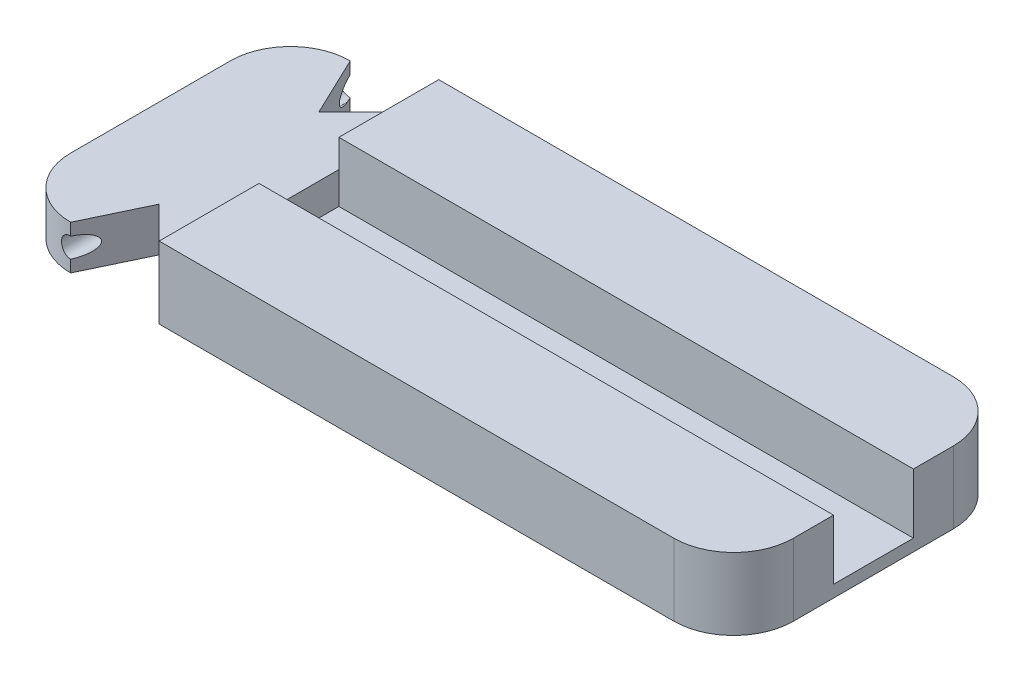
ISO-10303-21;
HEADER;
FILE_DESCRIPTION(('STEP AP214'),'2;1');
FILE_NAME('part.step','',(''),(''),'','','');
FILE_SCHEMA(('AUTOMOTIVE_DESIGN { 1 0 10303 214 1 1 1 1 }'));
ENDSEC;
DATA;
#1=APPLICATION_CONTEXT('core data for automotive mechanical design processes');
#2=APPLICATION_PROTOCOL_DEFINITION('international standard','automotive_design',2000,#1);
#3=PRODUCT_CONTEXT('',#1,'mechanical');
#4=PRODUCT('Part','Part','',(#3));
#5=PRODUCT_RELATED_PRODUCT_CATEGORY('part','',(#4));
#6=PRODUCT_DEFINITION_FORMATION('','',#4);
#7=PRODUCT_DEFINITION_CONTEXT('part definition',#1,'design');
#8=PRODUCT_DEFINITION('design','',#6,#7);
#9=PRODUCT_DEFINITION_SHAPE('','',#8);
#10=(LENGTH_UNIT() NAMED_UNIT(*) SI_UNIT(.MILLI.,.METRE.));
#11=(NAMED_UNIT(*) PLANE_ANGLE_UNIT() SI_UNIT($,.RADIAN.));
#12=(NAMED_UNIT(*) SI_UNIT($,.STERADIAN.) SOLID_ANGLE_UNIT());
#13=UNCERTAINTY_MEASURE_WITH_UNIT(LENGTH_MEASURE(1.E-05),#10,'distance_accuracy_value','');
#14=(GEOMETRIC_REPRESENTATION_CONTEXT(3) GLOBAL_UNCERTAINTY_ASSIGNED_CONTEXT((#13)) GLOBAL_UNIT_ASSIGNED_CONTEXT((#10,
#11,#12)) REPRESENTATION_CONTEXT('',''));
#15=CARTESIAN_POINT('',(0.,0.,0.));
#16=DIRECTION('',(0.,0.,1.));
#17=DIRECTION('',(1.,0.,0.));
#18=AXIS2_PLACEMENT_3D('',#15,#16,#17);
#19=CARTESIAN_POINT('',(75.5,18.,-20.));
#20=DIRECTION('',(0.,-1.,0.));
#21=DIRECTION('',(0.,0.,-1.));
#22=AXIS2_PLACEMENT_3D('',#19,#20,#21);
#23=PLANE('',#22);
#24=DIRECTION('',(0.,0.,-1.));
#25=VECTOR('',#24,1.);
#26=CARTESIAN_POINT('',(-53.344268465114,18.,-35.));
#27=LINE('',#26,#25);
#28=CARTESIAN_POINT('',(-53.344268465114,18.,-10.));
#29=VERTEX_POINT('',#28);
#30=CARTESIAN_POINT('',(-53.344268465114,18.,-35.));
#31=VERTEX_POINT('',#30);
#32=EDGE_CURVE('E259',#29,#31,#27,.T.);
#33=ORIENTED_EDGE('',*,*,#32,.F.);
#34=DIRECTION('',(-1.,0.,0.));
#35=VECTOR('',#34,1.);
#36=CARTESIAN_POINT('',(-53.344268465114,18.,-10.));
#37=LINE('',#36,#35);
#38=CARTESIAN_POINT('',(90.5,18.,-10.));
#39=VERTEX_POINT('',#38);
#40=EDGE_CURVE('E206',#39,#29,#37,.T.);
#41=ORIENTED_EDGE('',*,*,#40,.F.);
#42=DIRECTION('',(0.,0.,1.));
#43=VECTOR('',#42,1.);
#44=CARTESIAN_POINT('',(90.5,18.,-20.));
#45=LINE('',#44,#43);
#46=CARTESIAN_POINT('',(90.5,18.,-20.));
#47=VERTEX_POINT('',#46);
#48=EDGE_CURVE('E312',#47,#39,#45,.T.);
#49=ORIENTED_EDGE('',*,*,#48,.F.);
#50=CARTESIAN_POINT('',(75.5,18.,-20.));
#51=DIRECTION('',(0.,-1.,0.));
#52=DIRECTION('',(0.,0.,-1.));
#53=AXIS2_PLACEMENT_3D('',#50,#51,#52);
#54=CIRCLE('',#53,15.);
#55=CARTESIAN_POINT('',(75.5,18.,-35.));
#56=VERTEX_POINT('',#55);
#57=EDGE_CURVE('E313',#56,#47,#54,.T.);
#58=ORIENTED_EDGE('',*,*,#57,.F.);
#59=DIRECTION('',(1.,0.,0.));
#60=VECTOR('',#59,1.);
#61=CARTESIAN_POINT('',(-75.5,18.,-35.));
#62=LINE('',#61,#60);
#63=EDGE_CURVE('E319',#31,#56,#62,.T.);
#64=ORIENTED_EDGE('',*,*,#63,.F.);
#65=EDGE_LOOP('',(#33,#41,#49,#58,#64));
#66=FACE_BOUND('',#65,.T.);
#67=ADVANCED_FACE('F45',(#66),#23,.F.);
#68=CARTESIAN_POINT('',(-53.344268465114,11.,-35.));
#69=DIRECTION('',(1.,0.,0.));
#70=DIRECTION('',(0.,0.,-1.));
#71=AXIS2_PLACEMENT_3D('',#68,#69,#70);
#72=PLANE('',#71);
#73=DIRECTION('',(0.,0.,-1.));
#74=VECTOR('',#73,1.);
#75=CARTESIAN_POINT('',(-53.344268465114,11.,-35.));
#76=LINE('',#75,#74);
#77=CARTESIAN_POINT('',(-53.344268465114,11.,-10.));
#78=VERTEX_POINT('',#77);
#79=CARTESIAN_POINT('',(-53.344268465114,11.,-35.));
#80=VERTEX_POINT('',#79);
#81=EDGE_CURVE('E405',#78,#80,#76,.T.);
#82=ORIENTED_EDGE('',*,*,#81,.F.);
#83=DIRECTION('',(0.,1.,0.));
#84=VECTOR('',#83,1.);
#85=CARTESIAN_POINT('',(-53.344268465114,11.,-10.));
#86=LINE('',#85,#84);
#87=EDGE_CURVE('E11',#78,#29,#86,.T.);
#88=ORIENTED_EDGE('',*,*,#87,.T.);
#89=ORIENTED_EDGE('',*,*,#32,.T.);
#90=DIRECTION('',(0.,1.,0.));
#91=VECTOR('',#90,1.);
#92=CARTESIAN_POINT('',(-53.344268465114,11.,-35.));
#93=LINE('',#92,#91);
#94=EDGE_CURVE('E408',#80,#31,#93,.T.);
#95=ORIENTED_EDGE('',*,*,#94,.F.);
#96=EDGE_LOOP('',(#82,#88,#89,#95));
#97=FACE_BOUND('',#96,.T.);
#98=ADVANCED_FACE('F267',(#97),#72,.F.);
#99=CARTESIAN_POINT('',(-75.5,18.,-20.));
#100=DIRECTION('',(0.,-1.,0.));
#101=DIRECTION('',(0.,0.,-1.));
#102=AXIS2_PLACEMENT_3D('',#99,#100,#101);
#103=CYLINDRICAL_SURFACE('',#102,15.);
#104=DIRECTION('',(0.,-1.,0.));
#105=VECTOR('',#104,1.);
#106=CARTESIAN_POINT('',(-75.5,18.,-35.));
#107=LINE('',#106,#105);
#108=CARTESIAN_POINT('',(-75.5000000000001,11.,-35.));
#109=VERTEX_POINT('',#108);
#110=CARTESIAN_POINT('',(-75.5,8.,-35.));
#111=VERTEX_POINT('',#110);
#112=EDGE_CURVE('E360',#109,#111,#107,.T.);
#113=ORIENTED_EDGE('',*,*,#112,.T.);
#114=CARTESIAN_POINT('',(-75.5,8.,-35.));
#115=CARTESIAN_POINT('',(-75.5698011569821,8.00000728759552,-35.0000046902532));
#116=CARTESIAN_POINT('',(-75.6395984847442,7.99707674472405,-34.9995128810186));
#117=CARTESIAN_POINT('',(-75.7786844980967,7.9853964712709,-34.9975709664752));
#118=CARTESIAN_POINT('',(-75.8479732326524,7.97664730851365,-34.9961209546751));
#119=CARTESIAN_POINT('',(-75.985468472679,7.95340085874767,-34.9922997269917));
#120=CARTESIAN_POINT('',(-76.053676228338,7.93891080654415,-34.9899296706461));
#121=CARTESIAN_POINT('',(-76.1885946023829,7.90430746059178,-34.984338680445));
#122=CARTESIAN_POINT('',(-76.2553052231973,7.88419417596501,-34.9811177479699));
#123=CARTESIAN_POINT('',(-76.452519163041,7.81560717406301,-34.9703027439545));
#124=CARTESIAN_POINT('',(-76.5801961580564,7.75887071365379,-34.9615537464984));
#125=CARTESIAN_POINT('',(-76.8241486227517,7.6250916693769,-34.9419431437787));
#126=CARTESIAN_POINT('',(-76.9404240252278,7.54804896582922,-34.931081526064));
#127=CARTESIAN_POINT('',(-77.1594617261066,7.37505050886061,-34.9083338380496));
#128=CARTESIAN_POINT('',(-77.2621015701577,7.27894047959154,-34.8964398885049));
#129=CARTESIAN_POINT('',(-77.449881848487,7.07086236563362,-34.8730273406679));
#130=CARTESIAN_POINT('',(-77.5350195055262,6.95889176895109,-34.8615088021892));
#131=CARTESIAN_POINT('',(-77.6858688948242,6.72142571278372,-34.840075357156));
#132=CARTESIAN_POINT('',(-77.7514582099541,6.59585147207279,-34.8301707253743));
#133=CARTESIAN_POINT('',(-77.8605609775346,6.33528265457479,-34.8131974882504));
#134=CARTESIAN_POINT('',(-77.9040771842125,6.20028925547904,-34.8061285291031));
#135=CARTESIAN_POINT('',(-77.9674139710339,5.92602136650627,-34.7957054313148));
#136=CARTESIAN_POINT('',(-77.9874485448792,5.78679759313952,-34.792317765192));
#137=CARTESIAN_POINT('',(-78.0039168160758,5.50692307976073,-34.7895393754027));
#138=CARTESIAN_POINT('',(-78.0003516219806,5.36627240708441,-34.7901484639964));
#139=CARTESIAN_POINT('',(-77.9698950507454,5.08907169662377,-34.7952642967123));
#140=CARTESIAN_POINT('',(-77.9432447203062,4.95249432295285,-34.7997307620545));
#141=CARTESIAN_POINT('',(-77.8677528195122,4.68577785109364,-34.8119950015662));
#142=CARTESIAN_POINT('',(-77.8189106293724,4.55563893283423,-34.8197928687764));
#143=CARTESIAN_POINT('',(-77.7001761747331,4.30476883553954,-34.8378849628515));
#144=CARTESIAN_POINT('',(-77.6301834443452,4.18408609740114,-34.8481910573899));
#145=CARTESIAN_POINT('',(-77.4712085472173,3.956091577392,-34.8701296177779));
#146=CARTESIAN_POINT('',(-77.382225554592,3.84878037737011,-34.8817621413034));
#147=CARTESIAN_POINT('',(-77.1864963382332,3.64918779002656,-34.9052186555504));
#148=CARTESIAN_POINT('',(-77.0795455322428,3.55710700179613,-34.917043244119));
#149=CARTESIAN_POINT('',(-76.8515667060301,3.39214232149392,-34.9394230744496));
#150=CARTESIAN_POINT('',(-76.7305347251196,3.31926384947158,-34.9499779573684));
#151=CARTESIAN_POINT('',(-76.4776240183351,3.19475409092223,-34.9686455903858));
#152=CARTESIAN_POINT('',(-76.3457302661356,3.14315285276235,-34.9767548824368));
#153=CARTESIAN_POINT('',(-76.0750733777964,3.06296384028726,-34.9895815179928));
#154=CARTESIAN_POINT('',(-75.9363208028379,3.03434178666502,-34.9943039127909));
#155=CARTESIAN_POINT('',(-75.7470944944281,3.01174483325429,-34.9980464493542));
#156=CARTESIAN_POINT('',(-75.6977374183934,3.00733866878688,-34.9987784294605));
#157=CARTESIAN_POINT('',(-75.5989274224214,3.00147009035062,-34.9997547015207));
#158=CARTESIAN_POINT('',(-75.5494748054966,3.00000271327631,-34.9999998157015));
#159=CARTESIAN_POINT('',(-75.5,3.00000000000001,-35.));
#160=B_SPLINE_CURVE_WITH_KNOTS('',3,(#114,#115,#116,#117,#118,#119,#120,#121,#122,#123,#124,
#125,#126,#127,#128,#129,#130,#131,#132,#133,#134,#135,#136,#137,#138,#139,#140,#141,#142,#143,
#144,#145,#146,#147,#148,#149,#150,#151,#152,#153,#154,#155,#156,#157,#158,#159),.UNSPECIFIED.,
.F.,.F.,(4,2,2,2,2,2,2,2,2,2,2,2,2,2,2,2,2,2,2,2,2,2,4),(0.,0.209333491845771,0.418646558361396,
0.627696678366011,0.83674645924878,1.25457066181017,1.67239732697976,2.09375371686283,
2.51517691586343,2.93918625952091,3.36314268333222,3.7832046862671,4.20324695774168,
4.61895545583438,5.03467556474893,5.45240225764213,5.87014712114383,6.29301835923139,
6.71600882947926,7.13959463075992,7.56254736567457,7.71115631451634,7.85951407610113),.UNSPECIFIED.);
#161=CARTESIAN_POINT('',(-75.5000000000001,3.00000000000001,-35.));
#162=VERTEX_POINT('',#161);
#163=EDGE_CURVE('E68',#111,#162,#160,.T.);
#164=ORIENTED_EDGE('',*,*,#163,.T.);
#165=CARTESIAN_POINT('',(-75.5000000000001,0.,-35.));
#166=VERTEX_POINT('',#165);
#167=EDGE_CURVE('E365',#162,#166,#107,.T.);
#168=ORIENTED_EDGE('',*,*,#167,.T.);
#169=CARTESIAN_POINT('',(-75.5,0.,-20.));
#170=DIRECTION('',(0.,1.,0.));
#171=DIRECTION('',(0.,0.,1.));
#172=AXIS2_PLACEMENT_3D('',#169,#170,#171);
#173=CIRCLE('',#172,15.);
#174=CARTESIAN_POINT('',(-90.5,0.,-20.));
#175=VERTEX_POINT('',#174);
#176=EDGE_CURVE('E356',#166,#175,#173,.T.);
#177=ORIENTED_EDGE('',*,*,#176,.T.);
#178=DIRECTION('',(0.,-1.,0.));
#179=VECTOR('',#178,1.);
#180=CARTESIAN_POINT('',(-90.5,18.,-20.));
#181=LINE('',#180,#179);
#182=CARTESIAN_POINT('',(-90.5,11.,-20.));
#183=VERTEX_POINT('',#182);
#184=EDGE_CURVE('E366',#183,#175,#181,.T.);
#185=ORIENTED_EDGE('',*,*,#184,.F.);
#186=CARTESIAN_POINT('',(-75.5,11.,-20.));
#187=DIRECTION('',(0.,1.,0.));
#188=DIRECTION('',(0.,0.,1.));
#189=AXIS2_PLACEMENT_3D('',#186,#187,#188);
#190=CIRCLE('',#189,15.);
#191=EDGE_CURVE('E430',#109,#183,#190,.T.);
#192=ORIENTED_EDGE('',*,*,#191,.F.);
#193=EDGE_LOOP('',(#113,#164,#168,#177,#185,#192));
#194=FACE_BOUND('',#193,.T.);
#195=ADVANCED_FACE('F262',(#194),#103,.T.);
#196=CARTESIAN_POINT('',(-90.5,18.,20.));
#197=DIRECTION('',(-1.,0.,0.));
#198=DIRECTION('',(0.,0.,1.));
#199=AXIS2_PLACEMENT_3D('',#196,#197,#198);
#200=PLANE('',#199);
#201=DIRECTION('',(0.,-1.,0.));
#202=VECTOR('',#201,1.);
#203=CARTESIAN_POINT('',(-90.5,18.,20.));
#204=LINE('',#203,#202);
#205=CARTESIAN_POINT('',(-90.5,11.,20.));
#206=VERTEX_POINT('',#205);
#207=CARTESIAN_POINT('',(-90.5,0.,20.));
#208=VERTEX_POINT('',#207);
#209=EDGE_CURVE('E369',#206,#208,#204,.T.);
#210=ORIENTED_EDGE('',*,*,#209,.F.);
#211=DIRECTION('',(0.,0.,-1.));
#212=VECTOR('',#211,1.);
#213=CARTESIAN_POINT('',(-90.5,11.,20.));
#214=LINE('',#213,#212);
#215=EDGE_CURVE('E426',#206,#183,#214,.T.);
#216=ORIENTED_EDGE('',*,*,#215,.T.);
#217=ORIENTED_EDGE('',*,*,#184,.T.);
#218=DIRECTION('',(0.,0.,-1.));
#219=VECTOR('',#218,1.);
#220=CARTESIAN_POINT('',(-90.5,0.,20.));
#221=LINE('',#220,#219);
#222=EDGE_CURVE('E352',#208,#175,#221,.T.);
#223=ORIENTED_EDGE('',*,*,#222,.F.);
#224=EDGE_LOOP('',(#210,#216,#217,#223));
#225=FACE_BOUND('',#224,.T.);
#226=ADVANCED_FACE('F266',(#225),#200,.T.);
#227=CARTESIAN_POINT('',(-75.5,18.,20.));
#228=DIRECTION('',(0.,-1.,0.));
#229=DIRECTION('',(0.,0.,-1.));
#230=AXIS2_PLACEMENT_3D('',#227,#228,#229);
#231=CYLINDRICAL_SURFACE('',#230,15.);
#232=CARTESIAN_POINT('',(-75.5,8.,35.));
#233=CARTESIAN_POINT('',(-75.5698011569821,8.00000728759552,35.0000046902532));
#234=CARTESIAN_POINT('',(-75.6395984847442,7.99707674472405,34.9995128810186));
#235=CARTESIAN_POINT('',(-75.7786844980967,7.9853964712709,34.9975709664752));
#236=CARTESIAN_POINT('',(-75.8479732326524,7.97664730851365,34.9961209546751));
#237=CARTESIAN_POINT('',(-75.985468472679,7.95340085874767,34.9922997269917));
#238=CARTESIAN_POINT('',(-76.053676228338,7.93891080654415,34.9899296706461));
#239=CARTESIAN_POINT('',(-76.1885946023829,7.90430746059178,34.984338680445));
#240=CARTESIAN_POINT('',(-76.2553052231973,7.88419417596501,34.9811177479699));
#241=CARTESIAN_POINT('',(-76.452519163041,7.81560717406301,34.9703027439545));
#242=CARTESIAN_POINT('',(-76.5801961580564,7.75887071365379,34.9615537464984));
#243=CARTESIAN_POINT('',(-76.8241486227517,7.6250916693769,34.9419431437787));
#244=CARTESIAN_POINT('',(-76.9404240252278,7.54804896582922,34.931081526064));
#245=CARTESIAN_POINT('',(-77.1594617261066,7.37505050886061,34.9083338380496));
#246=CARTESIAN_POINT('',(-77.2621015701577,7.27894047959154,34.8964398885049));
#247=CARTESIAN_POINT('',(-77.449881848487,7.07086236563362,34.8730273406679));
#248=CARTESIAN_POINT('',(-77.5350195055262,6.95889176895109,34.8615088021892));
#249=CARTESIAN_POINT('',(-77.6858688948242,6.72142571278372,34.840075357156));
#250=CARTESIAN_POINT('',(-77.7514582099541,6.59585147207279,34.8301707253743));
#251=CARTESIAN_POINT('',(-77.8605609775346,6.33528265457479,34.8131974882504));
#252=CARTESIAN_POINT('',(-77.9040771842125,6.20028925547904,34.8061285291031));
#253=CARTESIAN_POINT('',(-77.9674139710339,5.92602136650627,34.7957054313148));
#254=CARTESIAN_POINT('',(-77.9874485448792,5.78679759313952,34.792317765192));
#255=CARTESIAN_POINT('',(-78.0039168160758,5.50692307976073,34.7895393754027));
#256=CARTESIAN_POINT('',(-78.0003516219806,5.36627240708441,34.7901484639964));
#257=CARTESIAN_POINT('',(-77.9698950507454,5.08907169662377,34.7952642967123));
#258=CARTESIAN_POINT('',(-77.9432447203062,4.95249432295285,34.7997307620545));
#259=CARTESIAN_POINT('',(-77.8677528195122,4.68577785109364,34.8119950015662));
#260=CARTESIAN_POINT('',(-77.8189106293724,4.55563893283423,34.8197928687764));
#261=CARTESIAN_POINT('',(-77.7001761747331,4.30476883553954,34.8378849628515));
#262=CARTESIAN_POINT('',(-77.6301834443452,4.18408609740114,34.8481910573899));
#263=CARTESIAN_POINT('',(-77.4712085472173,3.956091577392,34.8701296177779));
#264=CARTESIAN_POINT('',(-77.382225554592,3.84878037737011,34.8817621413034));
#265=CARTESIAN_POINT('',(-77.1864963382332,3.64918779002656,34.9052186555504));
#266=CARTESIAN_POINT('',(-77.0795455322428,3.55710700179613,34.917043244119));
#267=CARTESIAN_POINT('',(-76.8515667060301,3.39214232149392,34.9394230744496));
#268=CARTESIAN_POINT('',(-76.7305347251196,3.31926384947158,34.9499779573684));
#269=CARTESIAN_POINT('',(-76.4776240183351,3.19475409092223,34.9686455903858));
#270=CARTESIAN_POINT('',(-76.3457302661356,3.14315285276235,34.9767548824368));
#271=CARTESIAN_POINT('',(-76.0750733777964,3.06296384028726,34.9895815179928));
#272=CARTESIAN_POINT('',(-75.9363208028379,3.03434178666502,34.9943039127909));
#273=CARTESIAN_POINT('',(-75.7470944944281,3.01174483325429,34.9980464493542));
#274=CARTESIAN_POINT('',(-75.6977374183934,3.00733866878688,34.9987784294605));
#275=CARTESIAN_POINT('',(-75.5989274224214,3.00147009035062,34.9997547015207));
#276=CARTESIAN_POINT('',(-75.5494748054966,3.00000271327631,34.9999998157015));
#277=CARTESIAN_POINT('',(-75.5,3.00000000000001,35.));
#278=B_SPLINE_CURVE_WITH_KNOTS('',3,(#232,#233,#234,#235,#236,#237,#238,#239,#240,#241,#242,
#243,#244,#245,#246,#247,#248,#249,#250,#251,#252,#253,#254,#255,#256,#257,#258,#259,#260,#261,
#262,#263,#264,#265,#266,#267,#268,#269,#270,#271,#272,#273,#274,#275,#276,#277),.UNSPECIFIED.,
.F.,.F.,(4,2,2,2,2,2,2,2,2,2,2,2,2,2,2,2,2,2,2,2,2,2,4),(0.,0.209333491845771,0.418646558361396,
0.627696678366011,0.83674645924878,1.25457066181017,1.67239732697976,2.09375371686283,
2.51517691586343,2.93918625952091,3.36314268333222,3.7832046862671,4.20324695774168,
4.61895545583438,5.03467556474893,5.45240225764213,5.87014712114383,6.29301835923139,
6.71600882947926,7.13959463075992,7.56254736567457,7.71115631451634,7.85951407610113),.UNSPECIFIED.);
#279=CARTESIAN_POINT('',(-75.5,8.,35.));
#280=VERTEX_POINT('',#279);
#281=CARTESIAN_POINT('',(-75.5,3.00000000000001,35.));
#282=VERTEX_POINT('',#281);
#283=EDGE_CURVE('E221',#280,#282,#278,.T.);
#284=ORIENTED_EDGE('',*,*,#283,.F.);
#285=DIRECTION('',(0.,-1.,0.));
#286=VECTOR('',#285,1.);
#287=CARTESIAN_POINT('',(-75.5,18.,35.));
#288=LINE('',#287,#286);
#289=CARTESIAN_POINT('',(-75.5,11.,35.));
#290=VERTEX_POINT('',#289);
#291=EDGE_CURVE('E372',#290,#280,#288,.T.);
#292=ORIENTED_EDGE('',*,*,#291,.F.);
#293=CARTESIAN_POINT('',(-75.5,11.,20.));
#294=DIRECTION('',(0.,1.,0.));
#295=DIRECTION('',(0.,0.,1.));
#296=AXIS2_PLACEMENT_3D('',#293,#294,#295);
#297=CIRCLE('',#296,15.);
#298=EDGE_CURVE('E422',#290,#206,#297,.F.);
#299=ORIENTED_EDGE('',*,*,#298,.T.);
#300=ORIENTED_EDGE('',*,*,#209,.T.);
#301=CARTESIAN_POINT('',(-75.5,0.,20.));
#302=DIRECTION('',(0.,-1.,0.));
#303=DIRECTION('',(0.,0.,-1.));
#304=AXIS2_PLACEMENT_3D('',#301,#302,#303);
#305=CIRCLE('',#304,15.);
#306=CARTESIAN_POINT('',(-75.5,0.,35.));
#307=VERTEX_POINT('',#306);
#308=EDGE_CURVE('E348',#307,#208,#305,.T.);
#309=ORIENTED_EDGE('',*,*,#308,.F.);
#310=EDGE_CURVE('E376',#282,#307,#288,.T.);
#311=ORIENTED_EDGE('',*,*,#310,.F.);
#312=EDGE_LOOP('',(#284,#292,#299,#300,#309,#311));
#313=FACE_BOUND('',#312,.T.);
#314=ADVANCED_FACE('F237',(#313),#231,.T.);
#315=CARTESIAN_POINT('',(-75.5000000000001,0.,-35.));
#316=DIRECTION('',(-0.902559598022754,0.,0.430564945179011));
#317=DIRECTION('',(0.430564945179011,0.,0.902559598022754));
#318=AXIS2_PLACEMENT_3D('',#315,#316,#317);
#319=PLANE('',#318);
#320=ORIENTED_EDGE('',*,*,#167,.F.);
#321=CARTESIAN_POINT('',(-75.5,5.50000000000001,-35.));
#322=DIRECTION('',(-0.902559598022754,0.,0.430564945179011));
#323=DIRECTION('',(0.430564945179011,0.,0.902559598022754));
#324=AXIS2_PLACEMENT_3D('',#321,#322,#323);
#325=ELLIPSE('',#324,5.80632498765221,2.5);
#326=EDGE_CURVE('E235',#162,#111,#325,.T.);
#327=ORIENTED_EDGE('',*,*,#326,.T.);
#328=ORIENTED_EDGE('',*,*,#112,.F.);
#329=DIRECTION('',(-0.430564945179011,0.,-0.902559598022754));
#330=VECTOR('',#329,1.);
#331=CARTESIAN_POINT('',(-75.5000000000001,11.,-35.));
#332=LINE('',#331,#330);
#333=CARTESIAN_POINT('',(-68.3442684651144,11.,-20.));
#334=VERTEX_POINT('',#333);
#335=EDGE_CURVE('E433',#334,#109,#332,.T.);
#336=ORIENTED_EDGE('',*,*,#335,.F.);
#337=DIRECTION('',(0.,1.,0.));
#338=VECTOR('',#337,1.);
#339=CARTESIAN_POINT('',(-68.3442684651144,0.,-20.));
#340=LINE('',#339,#338);
#341=CARTESIAN_POINT('',(-68.3442684651144,0.,-20.));
#342=VERTEX_POINT('',#341);
#343=EDGE_CURVE('E463',#342,#334,#340,.T.);
#344=ORIENTED_EDGE('',*,*,#343,.F.);
#345=DIRECTION('',(0.430564945179011,0.,0.902559598022754));
#346=VECTOR('',#345,1.);
#347=CARTESIAN_POINT('',(-75.5000000000001,0.,-35.));
#348=LINE('',#347,#346);
#349=EDGE_CURVE('E452',#166,#342,#348,.T.);
#350=ORIENTED_EDGE('',*,*,#349,.F.);
#351=EDGE_LOOP('',(#320,#327,#328,#336,#344,#350));
#352=FACE_BOUND('',#351,.T.);
#353=ADVANCED_FACE('F278',(#352),#319,.F.);
#354=CARTESIAN_POINT('',(-68.3442684651144,0.,-20.));
#355=DIRECTION('',(0.707106781186539,0.,0.707106781186556));
#356=DIRECTION('',(0.707106781186556,0.,-0.707106781186539));
#357=AXIS2_PLACEMENT_3D('',#354,#355,#356);
#358=PLANE('',#357);
#359=DIRECTION('',(-0.707106781186556,0.,0.707106781186539));
#360=VECTOR('',#359,1.);
#361=CARTESIAN_POINT('',(-68.3442684651144,11.,-20.));
#362=LINE('',#361,#360);
#363=EDGE_CURVE('E436',#80,#334,#362,.T.);
#364=ORIENTED_EDGE('',*,*,#363,.F.);
#365=DIRECTION('',(0.,1.,0.));
#366=VECTOR('',#365,1.);
#367=CARTESIAN_POINT('',(-53.344268465114,0.,-35.));
#368=LINE('',#367,#366);
#369=CARTESIAN_POINT('',(-53.344268465114,0.,-35.));
#370=VERTEX_POINT('',#369);
#371=EDGE_CURVE('E333',#370,#80,#368,.T.);
#372=ORIENTED_EDGE('',*,*,#371,.F.);
#373=DIRECTION('',(0.707106781186556,0.,-0.707106781186539));
#374=VECTOR('',#373,1.);
#375=CARTESIAN_POINT('',(-68.3442684651144,0.,-20.));
#376=LINE('',#375,#374);
#377=EDGE_CURVE('E459',#342,#370,#376,.T.);
#378=ORIENTED_EDGE('',*,*,#377,.F.);
#379=ORIENTED_EDGE('',*,*,#343,.T.);
#380=EDGE_LOOP('',(#364,#372,#378,#379));
#381=FACE_BOUND('',#380,.T.);
#382=ADVANCED_FACE('F484',(#381),#358,.F.);
#383=CARTESIAN_POINT('',(-75.5,0.,35.));
#384=DIRECTION('',(-0.902559598022755,0.,-0.43056494517901));
#385=DIRECTION('',(-0.43056494517901,0.,0.902559598022755));
#386=AXIS2_PLACEMENT_3D('',#383,#384,#385);
#387=PLANE('',#386);
#388=ORIENTED_EDGE('',*,*,#291,.T.);
#389=CARTESIAN_POINT('',(-75.5,5.50000000000001,35.));
#390=DIRECTION('',(-0.902559598022755,0.,-0.43056494517901));
#391=DIRECTION('',(-0.43056494517901,0.,0.902559598022755));
#392=AXIS2_PLACEMENT_3D('',#389,#390,#391);
#393=ELLIPSE('',#392,5.80632498765223,2.5);
#394=EDGE_CURVE('E392',#280,#282,#393,.T.);
#395=ORIENTED_EDGE('',*,*,#394,.T.);
#396=ORIENTED_EDGE('',*,*,#310,.T.);
#397=DIRECTION('',(-0.43056494517901,0.,0.902559598022755));
#398=VECTOR('',#397,1.);
#399=CARTESIAN_POINT('',(-75.5,0.,35.));
#400=LINE('',#399,#398);
#401=CARTESIAN_POINT('',(-68.3442684651144,0.,20.));
#402=VERTEX_POINT('',#401);
#403=EDGE_CURVE('E443',#402,#307,#400,.T.);
#404=ORIENTED_EDGE('',*,*,#403,.F.);
#405=DIRECTION('',(0.,1.,0.));
#406=VECTOR('',#405,1.);
#407=CARTESIAN_POINT('',(-68.3442684651144,0.,20.));
#408=LINE('',#407,#406);
#409=CARTESIAN_POINT('',(-68.3442684651144,11.,20.));
#410=VERTEX_POINT('',#409);
#411=EDGE_CURVE('E448',#402,#410,#408,.T.);
#412=ORIENTED_EDGE('',*,*,#411,.T.);
#413=DIRECTION('',(0.43056494517901,0.,-0.902559598022755));
#414=VECTOR('',#413,1.);
#415=CARTESIAN_POINT('',(-75.5,11.,35.));
#416=LINE('',#415,#414);
#417=EDGE_CURVE('E418',#290,#410,#416,.T.);
#418=ORIENTED_EDGE('',*,*,#417,.F.);
#419=EDGE_LOOP('',(#388,#395,#396,#404,#412,#418));
#420=FACE_BOUND('',#419,.T.);
#421=ADVANCED_FACE('F499',(#420),#387,.F.);
#422=CARTESIAN_POINT('',(-68.3442684651144,0.,20.));
#423=DIRECTION('',(0.707106781186539,0.,-0.707106781186556));
#424=DIRECTION('',(-0.707106781186556,0.,-0.707106781186539));
#425=AXIS2_PLACEMENT_3D('',#422,#423,#424);
#426=PLANE('',#425);
#427=DIRECTION('',(0.707106781186556,0.,0.707106781186539));
#428=VECTOR('',#427,1.);
#429=CARTESIAN_POINT('',(-68.3442684651144,11.,20.));
#430=LINE('',#429,#428);
#431=CARTESIAN_POINT('',(-53.344268465114,11.,35.));
#432=VERTEX_POINT('',#431);
#433=EDGE_CURVE('E364',#410,#432,#430,.T.);
#434=ORIENTED_EDGE('',*,*,#433,.F.);
#435=ORIENTED_EDGE('',*,*,#411,.F.);
#436=DIRECTION('',(-0.707106781186556,0.,-0.707106781186539));
#437=VECTOR('',#436,1.);
#438=CARTESIAN_POINT('',(-68.3442684651144,0.,20.));
#439=LINE('',#438,#437);
#440=CARTESIAN_POINT('',(-53.344268465114,0.,35.));
#441=VERTEX_POINT('',#440);
#442=EDGE_CURVE('E439',#441,#402,#439,.T.);
#443=ORIENTED_EDGE('',*,*,#442,.F.);
#444=DIRECTION('',(0.,1.,0.));
#445=VECTOR('',#444,1.);
#446=CARTESIAN_POINT('',(-53.344268465114,0.,35.));
#447=LINE('',#446,#445);
#448=EDGE_CURVE('E447',#441,#432,#447,.T.);
#449=ORIENTED_EDGE('',*,*,#448,.T.);
#450=EDGE_LOOP('',(#434,#435,#443,#449));
#451=FACE_BOUND('',#450,.T.);
#452=ADVANCED_FACE('F502',(#451),#426,.F.);
#453=CARTESIAN_POINT('',(-75.5,18.,-35.));
#454=DIRECTION('',(0.,0.,-1.));
#455=DIRECTION('',(-1.,0.,0.));
#456=AXIS2_PLACEMENT_3D('',#453,#454,#455);
#457=PLANE('',#456);
#458=ORIENTED_EDGE('',*,*,#371,.T.);
#459=ORIENTED_EDGE('',*,*,#94,.T.);
#460=ORIENTED_EDGE('',*,*,#63,.T.);
#461=DIRECTION('',(0.,-1.,0.));
#462=VECTOR('',#461,1.);
#463=CARTESIAN_POINT('',(75.5,18.,-35.));
#464=LINE('',#463,#462);
#465=CARTESIAN_POINT('',(75.5,0.,-35.));
#466=VERTEX_POINT('',#465);
#467=EDGE_CURVE('E328',#56,#466,#464,.T.);
#468=ORIENTED_EDGE('',*,*,#467,.T.);
#469=DIRECTION('',(1.,0.,0.));
#470=VECTOR('',#469,1.);
#471=CARTESIAN_POINT('',(-75.5,0.,-35.));
#472=LINE('',#471,#470);
#473=EDGE_CURVE('E329',#370,#466,#472,.T.);
#474=ORIENTED_EDGE('',*,*,#473,.F.);
#475=EDGE_LOOP('',(#458,#459,#460,#468,#474));
#476=FACE_BOUND('',#475,.T.);
#477=ADVANCED_FACE('F47',(#476),#457,.T.);
#478=CARTESIAN_POINT('',(-75.5,18.,35.));
#479=DIRECTION('',(0.,0.,-1.));
#480=DIRECTION('',(-1.,0.,0.));
#481=AXIS2_PLACEMENT_3D('',#478,#479,#480);
#482=PLANE('',#481);
#483=DIRECTION('',(1.,0.,0.));
#484=VECTOR('',#483,1.);
#485=CARTESIAN_POINT('',(-75.5,18.,35.));
#486=LINE('',#485,#484);
#487=CARTESIAN_POINT('',(-53.344268465114,18.,35.));
#488=VERTEX_POINT('',#487);
#489=CARTESIAN_POINT('',(75.5,18.,35.));
#490=VERTEX_POINT('',#489);
#491=EDGE_CURVE('E325',#488,#490,#486,.T.);
#492=ORIENTED_EDGE('',*,*,#491,.F.);
#493=DIRECTION('',(0.,1.,0.));
#494=VECTOR('',#493,1.);
#495=CARTESIAN_POINT('',(-53.344268465114,11.,35.));
#496=LINE('',#495,#494);
#497=EDGE_CURVE('E404',#432,#488,#496,.T.);
#498=ORIENTED_EDGE('',*,*,#497,.F.);
#499=ORIENTED_EDGE('',*,*,#448,.F.);
#500=DIRECTION('',(1.,0.,0.));
#501=VECTOR('',#500,1.);
#502=CARTESIAN_POINT('',(-75.5,0.,35.));
#503=LINE('',#502,#501);
#504=CARTESIAN_POINT('',(75.5,0.,35.));
#505=VERTEX_POINT('',#504);
#506=EDGE_CURVE('E345',#441,#505,#503,.T.);
#507=ORIENTED_EDGE('',*,*,#506,.T.);
#508=DIRECTION('',(0.,-1.,0.));
#509=VECTOR('',#508,1.);
#510=CARTESIAN_POINT('',(75.5,18.,35.));
#511=LINE('',#510,#509);
#512=EDGE_CURVE('E377',#490,#505,#511,.T.);
#513=ORIENTED_EDGE('',*,*,#512,.F.);
#514=EDGE_LOOP('',(#492,#498,#499,#507,#513));
#515=FACE_BOUND('',#514,.T.);
#516=ADVANCED_FACE('F508',(#515),#482,.F.);
#517=CARTESIAN_POINT('',(75.5,18.,20.));
#518=DIRECTION('',(0.,-1.,0.));
#519=DIRECTION('',(0.,0.,-1.));
#520=AXIS2_PLACEMENT_3D('',#517,#518,#519);
#521=CYLINDRICAL_SURFACE('',#520,15.);
#522=CARTESIAN_POINT('',(75.5,0.,20.));
#523=DIRECTION('',(0.,1.,0.));
#524=DIRECTION('',(0.,0.,1.));
#525=AXIS2_PLACEMENT_3D('',#522,#523,#524);
#526=CIRCLE('',#525,15.);
#527=CARTESIAN_POINT('',(90.5,0.,20.));
#528=VERTEX_POINT('',#527);
#529=EDGE_CURVE('E341',#505,#528,#526,.T.);
#530=ORIENTED_EDGE('',*,*,#529,.T.);
#531=DIRECTION('',(0.,-1.,0.));
#532=VECTOR('',#531,1.);
#533=CARTESIAN_POINT('',(90.5,18.,20.));
#534=LINE('',#533,#532);
#535=CARTESIAN_POINT('',(90.5,18.,20.));
#536=VERTEX_POINT('',#535);
#537=EDGE_CURVE('E381',#536,#528,#534,.T.);
#538=ORIENTED_EDGE('',*,*,#537,.F.);
#539=CARTESIAN_POINT('',(75.5,18.,20.));
#540=DIRECTION('',(0.,1.,0.));
#541=DIRECTION('',(0.,0.,1.));
#542=AXIS2_PLACEMENT_3D('',#539,#540,#541);
#543=CIRCLE('',#542,15.);
#544=EDGE_CURVE('E308',#490,#536,#543,.T.);
#545=ORIENTED_EDGE('',*,*,#544,.F.);
#546=ORIENTED_EDGE('',*,*,#512,.T.);
#547=EDGE_LOOP('',(#530,#538,#545,#546));
#548=FACE_BOUND('',#547,.T.);
#549=ADVANCED_FACE('F510',(#548),#521,.T.);
#550=CARTESIAN_POINT('',(90.5,18.,-20.));
#551=DIRECTION('',(1.,0.,0.));
#552=DIRECTION('',(0.,0.,-1.));
#553=AXIS2_PLACEMENT_3D('',#550,#551,#552);
#554=PLANE('',#553);
#555=DIRECTION('',(0.,1.,0.));
#556=VECTOR('',#555,1.);
#557=CARTESIAN_POINT('',(90.5,3.,-10.));
#558=LINE('',#557,#556);
#559=CARTESIAN_POINT('',(90.5,3.,-10.));
#560=VERTEX_POINT('',#559);
#561=EDGE_CURVE('E222',#560,#39,#558,.T.);
#562=ORIENTED_EDGE('',*,*,#561,.F.);
#563=DIRECTION('',(0.,0.,-1.));
#564=VECTOR('',#563,1.);
#565=CARTESIAN_POINT('',(90.5,3.,-10.));
#566=LINE('',#565,#564);
#567=CARTESIAN_POINT('',(90.5,3.,10.));
#568=VERTEX_POINT('',#567);
#569=EDGE_CURVE('E201',#568,#560,#566,.T.);
#570=ORIENTED_EDGE('',*,*,#569,.F.);
#571=DIRECTION('',(0.,1.,0.));
#572=VECTOR('',#571,1.);
#573=CARTESIAN_POINT('',(90.5,3.,10.));
#574=LINE('',#573,#572);
#575=CARTESIAN_POINT('',(90.5,18.,10.));
#576=VERTEX_POINT('',#575);
#577=EDGE_CURVE('E191',#568,#576,#574,.T.);
#578=ORIENTED_EDGE('',*,*,#577,.T.);
#579=EDGE_CURVE('E304',#576,#536,#45,.T.);
#580=ORIENTED_EDGE('',*,*,#579,.T.);
#581=ORIENTED_EDGE('',*,*,#537,.T.);
#582=DIRECTION('',(0.,0.,1.));
#583=VECTOR('',#582,1.);
#584=CARTESIAN_POINT('',(90.5,0.,-20.));
#585=LINE('',#584,#583);
#586=CARTESIAN_POINT('',(90.5,0.,-20.));
#587=VERTEX_POINT('',#586);
#588=EDGE_CURVE('E337',#587,#528,#585,.T.);
#589=ORIENTED_EDGE('',*,*,#588,.F.);
#590=DIRECTION('',(0.,-1.,0.));
#591=VECTOR('',#590,1.);
#592=CARTESIAN_POINT('',(90.5,18.,-20.));
#593=LINE('',#592,#591);
#594=EDGE_CURVE('E384',#47,#587,#593,.T.);
#595=ORIENTED_EDGE('',*,*,#594,.F.);
#596=ORIENTED_EDGE('',*,*,#48,.T.);
#597=EDGE_LOOP('',(#562,#570,#578,#580,#581,#589,#595,#596));
#598=FACE_BOUND('',#597,.T.);
#599=ADVANCED_FACE('F299',(#598),#554,.T.);
#600=CARTESIAN_POINT('',(75.5,18.,-20.));
#601=DIRECTION('',(0.,-1.,0.));
#602=DIRECTION('',(0.,0.,-1.));
#603=AXIS2_PLACEMENT_3D('',#600,#601,#602);
#604=CYLINDRICAL_SURFACE('',#603,15.);
#605=CARTESIAN_POINT('',(75.5,0.,-20.));
#606=DIRECTION('',(0.,-1.,0.));
#607=DIRECTION('',(0.,0.,-1.));
#608=AXIS2_PLACEMENT_3D('',#605,#606,#607);
#609=CIRCLE('',#608,15.);
#610=EDGE_CURVE('E332',#466,#587,#609,.T.);
#611=ORIENTED_EDGE('',*,*,#610,.F.);
#612=ORIENTED_EDGE('',*,*,#467,.F.);
#613=ORIENTED_EDGE('',*,*,#57,.T.);
#614=ORIENTED_EDGE('',*,*,#594,.T.);
#615=EDGE_LOOP('',(#611,#612,#613,#614));
#616=FACE_BOUND('',#615,.T.);
#617=ADVANCED_FACE('F291',(#616),#604,.T.);
#618=ORIENTED_EDGE('',*,*,#579,.F.);
#619=DIRECTION('',(1.,0.,0.));
#620=VECTOR('',#619,1.);
#621=CARTESIAN_POINT('',(-53.344268465114,18.,10.));
#622=LINE('',#621,#620);
#623=CARTESIAN_POINT('',(-53.344268465114,18.,10.));
#624=VERTEX_POINT('',#623);
#625=EDGE_CURVE('E209',#624,#576,#622,.T.);
#626=ORIENTED_EDGE('',*,*,#625,.F.);
#627=EDGE_CURVE('E400',#488,#624,#27,.T.);
#628=ORIENTED_EDGE('',*,*,#627,.F.);
#629=ORIENTED_EDGE('',*,*,#491,.T.);
#630=ORIENTED_EDGE('',*,*,#544,.T.);
#631=EDGE_LOOP('',(#618,#626,#628,#629,#630));
#632=FACE_BOUND('',#631,.T.);
#633=ADVANCED_FACE('F283',(#632),#23,.F.);
#634=CARTESIAN_POINT('',(75.5,0.,-20.));
#635=DIRECTION('',(0.,-1.,0.));
#636=DIRECTION('',(0.,0.,-1.));
#637=AXIS2_PLACEMENT_3D('',#634,#635,#636);
#638=PLANE('',#637);
#639=ORIENTED_EDGE('',*,*,#403,.T.);
#640=ORIENTED_EDGE('',*,*,#308,.T.);
#641=ORIENTED_EDGE('',*,*,#222,.T.);
#642=ORIENTED_EDGE('',*,*,#176,.F.);
#643=ORIENTED_EDGE('',*,*,#349,.T.);
#644=ORIENTED_EDGE('',*,*,#377,.T.);
#645=ORIENTED_EDGE('',*,*,#473,.T.);
#646=ORIENTED_EDGE('',*,*,#610,.T.);
#647=ORIENTED_EDGE('',*,*,#588,.T.);
#648=ORIENTED_EDGE('',*,*,#529,.F.);
#649=ORIENTED_EDGE('',*,*,#506,.F.);
#650=ORIENTED_EDGE('',*,*,#442,.T.);
#651=EDGE_LOOP('',(#639,#640,#641,#642,#643,#644,#645,#646,#647,#648,#649,#650));
#652=FACE_BOUND('',#651,.T.);
#653=ADVANCED_FACE('F269',(#652),#638,.T.);
#654=CARTESIAN_POINT('',(0.,11.,0.));
#655=DIRECTION('',(0.,1.,0.));
#656=DIRECTION('',(0.,0.,1.));
#657=AXIS2_PLACEMENT_3D('',#654,#655,#656);
#658=PLANE('',#657);
#659=ORIENTED_EDGE('',*,*,#363,.T.);
#660=ORIENTED_EDGE('',*,*,#335,.T.);
#661=ORIENTED_EDGE('',*,*,#191,.T.);
#662=ORIENTED_EDGE('',*,*,#215,.F.);
#663=ORIENTED_EDGE('',*,*,#298,.F.);
#664=ORIENTED_EDGE('',*,*,#417,.T.);
#665=ORIENTED_EDGE('',*,*,#433,.T.);
#666=CARTESIAN_POINT('',(-53.344268465114,11.,9.99999999999999));
#667=VERTEX_POINT('',#666);
#668=EDGE_CURVE('E260',#432,#667,#76,.T.);
#669=ORIENTED_EDGE('',*,*,#668,.T.);
#670=EDGE_CURVE('E188',#667,#78,#76,.T.);
#671=ORIENTED_EDGE('',*,*,#670,.T.);
#672=ORIENTED_EDGE('',*,*,#81,.T.);
#673=EDGE_LOOP('',(#659,#660,#661,#662,#663,#664,#665,#669,#671,#672));
#674=FACE_BOUND('',#673,.T.);
#675=ADVANCED_FACE('F249',(#674),#658,.T.);
#676=ORIENTED_EDGE('',*,*,#627,.T.);
#677=DIRECTION('',(0.,-1.,0.));
#678=VECTOR('',#677,1.);
#679=CARTESIAN_POINT('',(-53.344268465114,11.,9.99999999999999));
#680=LINE('',#679,#678);
#681=EDGE_CURVE('E54',#624,#667,#680,.T.);
#682=ORIENTED_EDGE('',*,*,#681,.T.);
#683=ORIENTED_EDGE('',*,*,#668,.F.);
#684=ORIENTED_EDGE('',*,*,#497,.T.);
#685=EDGE_LOOP('',(#676,#682,#683,#684));
#686=FACE_BOUND('',#685,.T.);
#687=ADVANCED_FACE('F246',(#686),#72,.F.);
#688=CARTESIAN_POINT('',(-75.5,5.50000000000001,-42.0710678118655));
#689=DIRECTION('',(0.,0.,1.));
#690=DIRECTION('',(1.,0.,0.));
#691=AXIS2_PLACEMENT_3D('',#688,#689,#690);
#692=CYLINDRICAL_SURFACE('',#691,2.5);
#693=ORIENTED_EDGE('',*,*,#283,.T.);
#694=ORIENTED_EDGE('',*,*,#394,.F.);
#695=EDGE_LOOP('',(#693,#694));
#696=FACE_BOUND('',#695,.T.);
#697=ORIENTED_EDGE('',*,*,#326,.F.);
#698=ORIENTED_EDGE('',*,*,#163,.F.);
#699=EDGE_LOOP('',(#697,#698));
#700=FACE_BOUND('',#699,.T.);
#701=ADVANCED_FACE('F241',(#696,#700),#692,.F.);
#702=CARTESIAN_POINT('',(-53.344268465114,3.,-10.));
#703=DIRECTION('',(-1.,0.,0.));
#704=DIRECTION('',(0.,0.,1.));
#705=AXIS2_PLACEMENT_3D('',#702,#703,#704);
#706=PLANE('',#705);
#707=ORIENTED_EDGE('',*,*,#670,.F.);
#708=DIRECTION('',(0.,1.,0.));
#709=VECTOR('',#708,1.);
#710=CARTESIAN_POINT('',(-53.344268465114,3.,10.));
#711=LINE('',#710,#709);
#712=CARTESIAN_POINT('',(-53.344268465114,3.,10.));
#713=VERTEX_POINT('',#712);
#714=EDGE_CURVE('E61',#713,#667,#711,.T.);
#715=ORIENTED_EDGE('',*,*,#714,.F.);
#716=DIRECTION('',(0.,0.,1.));
#717=VECTOR('',#716,1.);
#718=CARTESIAN_POINT('',(-53.344268465114,3.,-10.));
#719=LINE('',#718,#717);
#720=CARTESIAN_POINT('',(-53.344268465114,3.,-10.));
#721=VERTEX_POINT('',#720);
#722=EDGE_CURVE('E185',#721,#713,#719,.T.);
#723=ORIENTED_EDGE('',*,*,#722,.F.);
#724=DIRECTION('',(0.,1.,0.));
#725=VECTOR('',#724,1.);
#726=CARTESIAN_POINT('',(-53.344268465114,3.,-10.));
#727=LINE('',#726,#725);
#728=EDGE_CURVE('E218',#721,#78,#727,.T.);
#729=ORIENTED_EDGE('',*,*,#728,.T.);
#730=EDGE_LOOP('',(#707,#715,#723,#729));
#731=FACE_BOUND('',#730,.T.);
#732=ADVANCED_FACE('F182',(#731),#706,.F.);
#733=CARTESIAN_POINT('',(-53.344268465114,3.,-10.));
#734=DIRECTION('',(0.,0.,-1.));
#735=DIRECTION('',(-1.,0.,0.));
#736=AXIS2_PLACEMENT_3D('',#733,#734,#735);
#737=PLANE('',#736);
#738=ORIENTED_EDGE('',*,*,#40,.T.);
#739=ORIENTED_EDGE('',*,*,#87,.F.);
#740=ORIENTED_EDGE('',*,*,#728,.F.);
#741=DIRECTION('',(-1.,0.,0.));
#742=VECTOR('',#741,1.);
#743=CARTESIAN_POINT('',(-53.344268465114,3.,-10.));
#744=LINE('',#743,#742);
#745=EDGE_CURVE('E192',#560,#721,#744,.T.);
#746=ORIENTED_EDGE('',*,*,#745,.F.);
#747=ORIENTED_EDGE('',*,*,#561,.T.);
#748=EDGE_LOOP('',(#738,#739,#740,#746,#747));
#749=FACE_BOUND('',#748,.T.);
#750=ADVANCED_FACE('F568',(#749),#737,.F.);
#751=CARTESIAN_POINT('',(-53.344268465114,3.,10.));
#752=DIRECTION('',(0.,0.,1.));
#753=DIRECTION('',(1.,0.,0.));
#754=AXIS2_PLACEMENT_3D('',#751,#752,#753);
#755=PLANE('',#754);
#756=ORIENTED_EDGE('',*,*,#625,.T.);
#757=ORIENTED_EDGE('',*,*,#577,.F.);
#758=DIRECTION('',(1.,0.,0.));
#759=VECTOR('',#758,1.);
#760=CARTESIAN_POINT('',(-53.344268465114,3.,10.));
#761=LINE('',#760,#759);
#762=EDGE_CURVE('E195',#713,#568,#761,.T.);
#763=ORIENTED_EDGE('',*,*,#762,.F.);
#764=ORIENTED_EDGE('',*,*,#714,.T.);
#765=ORIENTED_EDGE('',*,*,#681,.F.);
#766=EDGE_LOOP('',(#756,#757,#763,#764,#765));
#767=FACE_BOUND('',#766,.T.);
#768=ADVANCED_FACE('F196',(#767),#755,.F.);
#769=CARTESIAN_POINT('',(0.,3.,0.));
#770=DIRECTION('',(0.,1.,0.));
#771=DIRECTION('',(0.,0.,1.));
#772=AXIS2_PLACEMENT_3D('',#769,#770,#771);
#773=PLANE('',#772);
#774=ORIENTED_EDGE('',*,*,#722,.T.);
#775=ORIENTED_EDGE('',*,*,#762,.T.);
#776=ORIENTED_EDGE('',*,*,#569,.T.);
#777=ORIENTED_EDGE('',*,*,#745,.T.);
#778=EDGE_LOOP('',(#774,#775,#776,#777));
#779=FACE_BOUND('',#778,.T.);
#780=ADVANCED_FACE('F203',(#779),#773,.T.);
#781=CLOSED_SHELL('',(#67,#98,#195,#226,#314,#353,#382,#421,#452,#477,#516,#549,#599,#617,#633,
#653,#675,#687,#701,#732,#750,#768,#780));
#782=MANIFOLD_SOLID_BREP('B2',#781);
#783=ADVANCED_BREP_SHAPE_REPRESENTATION('',(#18,#782),#14);
#784=SHAPE_DEFINITION_REPRESENTATION(#9,#783);
ENDSEC;
END-ISO-10303-21;
